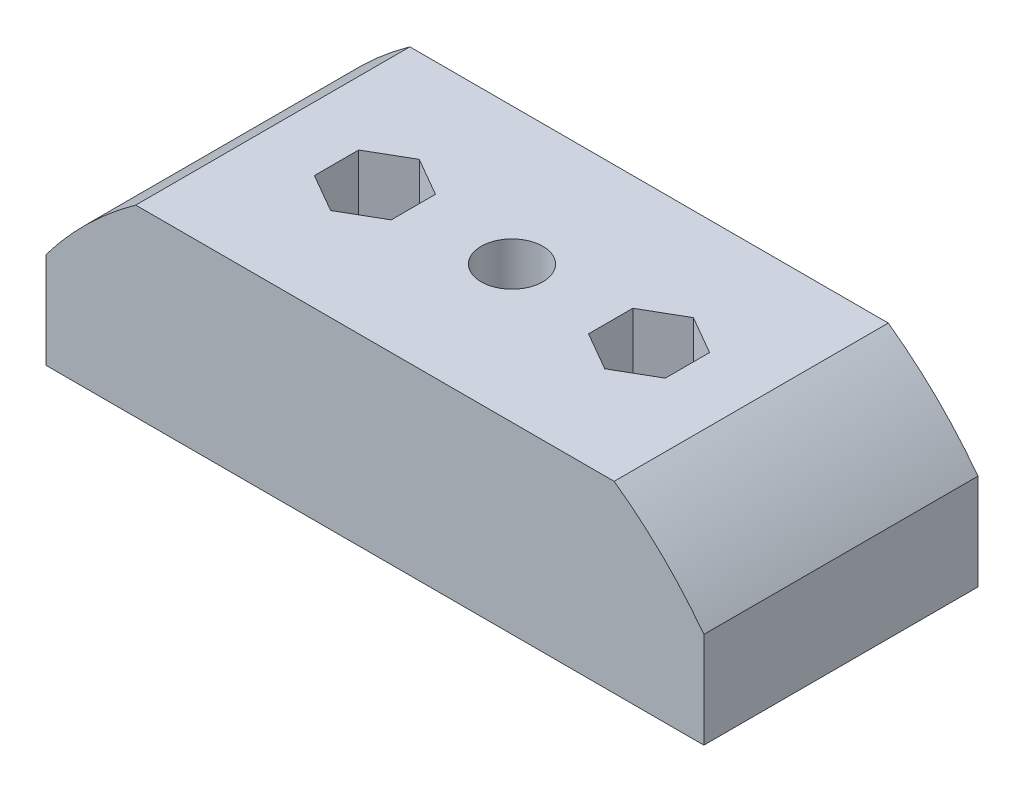
ISO-10303-21;
HEADER;
FILE_DESCRIPTION(('STEP AP214'),'2;1');
FILE_NAME('part.step','',(''),(''),'','','');
FILE_SCHEMA(('AUTOMOTIVE_DESIGN { 1 0 10303 214 1 1 1 1 }'));
ENDSEC;
DATA;
#1=APPLICATION_CONTEXT('core data for automotive mechanical design processes');
#2=APPLICATION_PROTOCOL_DEFINITION('international standard','automotive_design',2000,#1);
#3=PRODUCT_CONTEXT('',#1,'mechanical');
#4=PRODUCT('Part','Part','',(#3));
#5=PRODUCT_RELATED_PRODUCT_CATEGORY('part','',(#4));
#6=PRODUCT_DEFINITION_FORMATION('','',#4);
#7=PRODUCT_DEFINITION_CONTEXT('part definition',#1,'design');
#8=PRODUCT_DEFINITION('design','',#6,#7);
#9=PRODUCT_DEFINITION_SHAPE('','',#8);
#10=(LENGTH_UNIT() NAMED_UNIT(*) SI_UNIT(.MILLI.,.METRE.));
#11=(NAMED_UNIT(*) PLANE_ANGLE_UNIT() SI_UNIT($,.RADIAN.));
#12=(NAMED_UNIT(*) SI_UNIT($,.STERADIAN.) SOLID_ANGLE_UNIT());
#13=UNCERTAINTY_MEASURE_WITH_UNIT(LENGTH_MEASURE(1.E-05),#10,'distance_accuracy_value','');
#14=(GEOMETRIC_REPRESENTATION_CONTEXT(3) GLOBAL_UNCERTAINTY_ASSIGNED_CONTEXT((#13)) GLOBAL_UNIT_ASSIGNED_CONTEXT((#10,
#11,#12)) REPRESENTATION_CONTEXT('',''));
#15=CARTESIAN_POINT('',(0.,0.,0.));
#16=DIRECTION('',(0.,0.,1.));
#17=DIRECTION('',(1.,0.,0.));
#18=AXIS2_PLACEMENT_3D('',#15,#16,#17);
#19=CARTESIAN_POINT('',(0.,-44.001,0.));
#20=DIRECTION('',(0.,1.,0.));
#21=DIRECTION('',(-1.,0.,0.));
#22=AXIS2_PLACEMENT_3D('',#19,#20,#21);
#23=CYLINDRICAL_SURFACE('',#22,2.25);
#24=CARTESIAN_POINT('',(0.,-30.6,0.));
#25=DIRECTION('',(0.,1.,0.));
#26=DIRECTION('',(-1.,0.,0.));
#27=AXIS2_PLACEMENT_3D('',#24,#25,#26);
#28=CIRCLE('',#27,2.25);
#29=CARTESIAN_POINT('',(-2.25,-30.6,0.));
#30=VERTEX_POINT('',#29);
#31=EDGE_CURVE('E436',#30,#30,#28,.T.);
#32=ORIENTED_EDGE('',*,*,#31,.T.);
#33=EDGE_LOOP('',(#32));
#34=FACE_BOUND('',#33,.T.);
#35=CARTESIAN_POINT('',(0.,-36.6,0.));
#36=DIRECTION('',(0.,-1.,0.));
#37=DIRECTION('',(1.,0.,0.));
#38=AXIS2_PLACEMENT_3D('',#35,#36,#37);
#39=CIRCLE('',#38,2.25);
#40=CARTESIAN_POINT('',(2.25,-36.6,0.));
#41=VERTEX_POINT('',#40);
#42=EDGE_CURVE('E46',#41,#41,#39,.F.);
#43=ORIENTED_EDGE('',*,*,#42,.F.);
#44=EDGE_LOOP('',(#43));
#45=FACE_BOUND('',#44,.T.);
#46=ADVANCED_FACE('F42',(#34,#45),#23,.F.);
#47=CARTESIAN_POINT('',(-9.99999999999999,-44.001,0.));
#48=DIRECTION('',(0.,1.,0.));
#49=DIRECTION('',(-1.,0.,0.));
#50=AXIS2_PLACEMENT_3D('',#47,#48,#49);
#51=CYLINDRICAL_SURFACE('',#50,1.6);
#52=CARTESIAN_POINT('',(-9.99999999999999,-44.,0.));
#53=DIRECTION('',(0.,1.,0.));
#54=DIRECTION('',(-1.,0.,0.));
#55=AXIS2_PLACEMENT_3D('',#52,#53,#54);
#56=CIRCLE('',#55,1.6);
#57=CARTESIAN_POINT('',(-11.6,-44.,0.));
#58=VERTEX_POINT('',#57);
#59=EDGE_CURVE('E432',#58,#58,#56,.F.);
#60=ORIENTED_EDGE('',*,*,#59,.T.);
#61=EDGE_LOOP('',(#60));
#62=FACE_BOUND('',#61,.T.);
#63=CARTESIAN_POINT('',(-9.99999999999999,-38.,0.));
#64=DIRECTION('',(0.,1.,0.));
#65=DIRECTION('',(-1.,0.,0.));
#66=AXIS2_PLACEMENT_3D('',#63,#64,#65);
#67=CIRCLE('',#66,1.6);
#68=CARTESIAN_POINT('',(-11.6,-38.,0.));
#69=VERTEX_POINT('',#68);
#70=EDGE_CURVE('E441',#69,#69,#67,.F.);
#71=ORIENTED_EDGE('',*,*,#70,.F.);
#72=EDGE_LOOP('',(#71));
#73=FACE_BOUND('',#72,.T.);
#74=ADVANCED_FACE('F511',(#62,#73),#51,.F.);
#75=CARTESIAN_POINT('',(10.,-44.001,0.));
#76=DIRECTION('',(0.,1.,0.));
#77=DIRECTION('',(-1.,0.,0.));
#78=AXIS2_PLACEMENT_3D('',#75,#76,#77);
#79=CYLINDRICAL_SURFACE('',#78,1.6);
#80=CARTESIAN_POINT('',(10.,-44.,0.));
#81=DIRECTION('',(0.,1.,0.));
#82=DIRECTION('',(-1.,0.,0.));
#83=AXIS2_PLACEMENT_3D('',#80,#81,#82);
#84=CIRCLE('',#83,1.6);
#85=CARTESIAN_POINT('',(8.40000000000003,-44.,0.));
#86=VERTEX_POINT('',#85);
#87=EDGE_CURVE('E437',#86,#86,#84,.F.);
#88=ORIENTED_EDGE('',*,*,#87,.T.);
#89=EDGE_LOOP('',(#88));
#90=FACE_BOUND('',#89,.T.);
#91=CARTESIAN_POINT('',(10.,-38.,0.));
#92=DIRECTION('',(0.,1.,0.));
#93=DIRECTION('',(-1.,0.,0.));
#94=AXIS2_PLACEMENT_3D('',#91,#92,#93);
#95=CIRCLE('',#94,1.6);
#96=CARTESIAN_POINT('',(8.40000000000003,-38.,0.));
#97=VERTEX_POINT('',#96);
#98=EDGE_CURVE('E372',#97,#97,#95,.F.);
#99=ORIENTED_EDGE('',*,*,#98,.F.);
#100=EDGE_LOOP('',(#99));
#101=FACE_BOUND('',#100,.T.);
#102=ADVANCED_FACE('F513',(#90,#101),#79,.F.);
#103=CARTESIAN_POINT('',(0.,-55.,10.));
#104=DIRECTION('',(0.,0.,-1.));
#105=DIRECTION('',(-1.,0.,0.));
#106=AXIS2_PLACEMENT_3D('',#103,#104,#105);
#107=CYLINDRICAL_SURFACE('',#106,30.);
#108=CARTESIAN_POINT('',(0.,-55.,-10.));
#109=DIRECTION('',(0.,0.,1.));
#110=DIRECTION('',(1.,0.,0.));
#111=AXIS2_PLACEMENT_3D('',#108,#109,#110);
#112=CIRCLE('',#111,30.);
#113=CARTESIAN_POINT('',(-17.4539393834171,-30.6,-10.));
#114=VERTEX_POINT('',#113);
#115=CARTESIAN_POINT('',(-24.,-37.,-10.));
#116=VERTEX_POINT('',#115);
#117=EDGE_CURVE('E445',#114,#116,#112,.T.);
#118=ORIENTED_EDGE('',*,*,#117,.T.);
#119=DIRECTION('',(0.,0.,-1.));
#120=VECTOR('',#119,1.);
#121=CARTESIAN_POINT('',(-24.,-37.,10.));
#122=LINE('',#121,#120);
#123=CARTESIAN_POINT('',(-24.,-37.,10.));
#124=VERTEX_POINT('',#123);
#125=EDGE_CURVE('E12',#124,#116,#122,.T.);
#126=ORIENTED_EDGE('',*,*,#125,.F.);
#127=CARTESIAN_POINT('',(0.,-55.,10.));
#128=DIRECTION('',(0.,0.,1.));
#129=DIRECTION('',(1.,0.,0.));
#130=AXIS2_PLACEMENT_3D('',#127,#128,#129);
#131=CIRCLE('',#130,30.);
#132=CARTESIAN_POINT('',(-17.4539393834171,-30.6,10.));
#133=VERTEX_POINT('',#132);
#134=EDGE_CURVE('E446',#133,#124,#131,.T.);
#135=ORIENTED_EDGE('',*,*,#134,.F.);
#136=DIRECTION('',(0.,0.,-1.));
#137=VECTOR('',#136,1.);
#138=CARTESIAN_POINT('',(-17.4539393834171,-30.6,10.));
#139=LINE('',#138,#137);
#140=EDGE_CURVE('E466',#133,#114,#139,.T.);
#141=ORIENTED_EDGE('',*,*,#140,.T.);
#142=EDGE_LOOP('',(#118,#126,#135,#141));
#143=FACE_BOUND('',#142,.T.);
#144=ADVANCED_FACE('F44',(#143),#107,.T.);
#145=CARTESIAN_POINT('',(-24.,-37.,10.));
#146=DIRECTION('',(1.,0.,0.));
#147=DIRECTION('',(0.,1.,0.));
#148=AXIS2_PLACEMENT_3D('',#145,#146,#147);
#149=PLANE('',#148);
#150=DIRECTION('',(0.,-1.,0.));
#151=VECTOR('',#150,1.);
#152=CARTESIAN_POINT('',(-24.,-37.,-10.));
#153=LINE('',#152,#151);
#154=CARTESIAN_POINT('',(-24.,-44.,-10.));
#155=VERTEX_POINT('',#154);
#156=EDGE_CURVE('E470',#116,#155,#153,.T.);
#157=ORIENTED_EDGE('',*,*,#156,.T.);
#158=DIRECTION('',(0.,0.,-1.));
#159=VECTOR('',#158,1.);
#160=CARTESIAN_POINT('',(-24.,-44.,10.));
#161=LINE('',#160,#159);
#162=CARTESIAN_POINT('',(-24.,-44.,10.));
#163=VERTEX_POINT('',#162);
#164=EDGE_CURVE('E52',#163,#155,#161,.T.);
#165=ORIENTED_EDGE('',*,*,#164,.F.);
#166=DIRECTION('',(0.,-1.,0.));
#167=VECTOR('',#166,1.);
#168=CARTESIAN_POINT('',(-24.,-37.,10.));
#169=LINE('',#168,#167);
#170=EDGE_CURVE('E450',#124,#163,#169,.T.);
#171=ORIENTED_EDGE('',*,*,#170,.F.);
#172=ORIENTED_EDGE('',*,*,#125,.T.);
#173=EDGE_LOOP('',(#157,#165,#171,#172));
#174=FACE_BOUND('',#173,.T.);
#175=ADVANCED_FACE('F550',(#174),#149,.F.);
#176=CARTESIAN_POINT('',(-24.,-44.,10.));
#177=DIRECTION('',(0.,1.,0.));
#178=DIRECTION('',(-1.,0.,0.));
#179=AXIS2_PLACEMENT_3D('',#176,#177,#178);
#180=PLANE('',#179);
#181=DIRECTION('',(0.866025403784438,0.,0.5));
#182=VECTOR('',#181,1.);
#183=CARTESIAN_POINT('',(0.,-44.,-4.04145188432738));
#184=LINE('',#183,#182);
#185=CARTESIAN_POINT('',(0.,-44.,-4.04145188432739));
#186=VERTEX_POINT('',#185);
#187=CARTESIAN_POINT('',(3.50000000000001,-44.,-2.02072594216369));
#188=VERTEX_POINT('',#187);
#189=EDGE_CURVE('E272',#186,#188,#184,.T.);
#190=ORIENTED_EDGE('',*,*,#189,.F.);
#191=DIRECTION('',(0.866025403784439,0.,-0.5));
#192=VECTOR('',#191,1.);
#193=CARTESIAN_POINT('',(-3.49999999999999,-44.,-2.02072594216369));
#194=LINE('',#193,#192);
#195=CARTESIAN_POINT('',(-3.49999999999999,-44.,-2.02072594216369));
#196=VERTEX_POINT('',#195);
#197=EDGE_CURVE('E63',#196,#186,#194,.T.);
#198=ORIENTED_EDGE('',*,*,#197,.F.);
#199=DIRECTION('',(0.,0.,-1.));
#200=VECTOR('',#199,1.);
#201=CARTESIAN_POINT('',(-3.49999999999999,-44.,2.02072594216369));
#202=LINE('',#201,#200);
#203=CARTESIAN_POINT('',(-3.49999999999999,-44.,2.02072594216369));
#204=VERTEX_POINT('',#203);
#205=EDGE_CURVE('E292',#204,#196,#202,.T.);
#206=ORIENTED_EDGE('',*,*,#205,.F.);
#207=DIRECTION('',(-0.866025403784439,0.,-0.5));
#208=VECTOR('',#207,1.);
#209=CARTESIAN_POINT('',(0.,-44.,4.04145188432738));
#210=LINE('',#209,#208);
#211=CARTESIAN_POINT('',(0.,-44.,4.04145188432738));
#212=VERTEX_POINT('',#211);
#213=EDGE_CURVE('E285',#212,#204,#210,.T.);
#214=ORIENTED_EDGE('',*,*,#213,.F.);
#215=DIRECTION('',(-0.866025403784439,0.,0.5));
#216=VECTOR('',#215,1.);
#217=CARTESIAN_POINT('',(3.50000000000001,-44.,2.02072594216369));
#218=LINE('',#217,#216);
#219=CARTESIAN_POINT('',(3.50000000000001,-44.,2.02072594216369));
#220=VERTEX_POINT('',#219);
#221=EDGE_CURVE('E281',#220,#212,#218,.T.);
#222=ORIENTED_EDGE('',*,*,#221,.F.);
#223=DIRECTION('',(0.,0.,1.));
#224=VECTOR('',#223,1.);
#225=CARTESIAN_POINT('',(3.50000000000001,-44.,-2.02072594216369));
#226=LINE('',#225,#224);
#227=EDGE_CURVE('E261',#188,#220,#226,.T.);
#228=ORIENTED_EDGE('',*,*,#227,.F.);
#229=EDGE_LOOP('',(#190,#198,#206,#214,#222,#228));
#230=FACE_BOUND('',#229,.T.);
#231=ORIENTED_EDGE('',*,*,#87,.F.);
#232=EDGE_LOOP('',(#231));
#233=FACE_BOUND('',#232,.T.);
#234=ORIENTED_EDGE('',*,*,#59,.F.);
#235=EDGE_LOOP('',(#234));
#236=FACE_BOUND('',#235,.T.);
#237=DIRECTION('',(1.,0.,0.));
#238=VECTOR('',#237,1.);
#239=CARTESIAN_POINT('',(-24.,-44.,-10.));
#240=LINE('',#239,#238);
#241=CARTESIAN_POINT('',(24.,-44.,-10.));
#242=VERTEX_POINT('',#241);
#243=EDGE_CURVE('E473',#155,#242,#240,.T.);
#244=ORIENTED_EDGE('',*,*,#243,.T.);
#245=DIRECTION('',(0.,0.,-1.));
#246=VECTOR('',#245,1.);
#247=CARTESIAN_POINT('',(24.,-44.,10.));
#248=LINE('',#247,#246);
#249=CARTESIAN_POINT('',(24.,-44.,10.));
#250=VERTEX_POINT('',#249);
#251=EDGE_CURVE('E495',#250,#242,#248,.T.);
#252=ORIENTED_EDGE('',*,*,#251,.F.);
#253=DIRECTION('',(1.,0.,0.));
#254=VECTOR('',#253,1.);
#255=CARTESIAN_POINT('',(-24.,-44.,10.));
#256=LINE('',#255,#254);
#257=EDGE_CURVE('E454',#163,#250,#256,.T.);
#258=ORIENTED_EDGE('',*,*,#257,.F.);
#259=ORIENTED_EDGE('',*,*,#164,.T.);
#260=EDGE_LOOP('',(#244,#252,#258,#259));
#261=FACE_BOUND('',#260,.T.);
#262=ADVANCED_FACE('F277',(#230,#233,#236,#261),#180,.F.);
#263=CARTESIAN_POINT('',(24.,-44.,10.));
#264=DIRECTION('',(-1.,0.,0.));
#265=DIRECTION('',(0.,0.,1.));
#266=AXIS2_PLACEMENT_3D('',#263,#264,#265);
#267=PLANE('',#266);
#268=DIRECTION('',(0.,1.,0.));
#269=VECTOR('',#268,1.);
#270=CARTESIAN_POINT('',(24.,-44.,-10.));
#271=LINE('',#270,#269);
#272=CARTESIAN_POINT('',(24.,-37.,-10.));
#273=VERTEX_POINT('',#272);
#274=EDGE_CURVE('E476',#242,#273,#271,.T.);
#275=ORIENTED_EDGE('',*,*,#274,.T.);
#276=DIRECTION('',(0.,0.,-1.));
#277=VECTOR('',#276,1.);
#278=CARTESIAN_POINT('',(24.,-37.,10.));
#279=LINE('',#278,#277);
#280=CARTESIAN_POINT('',(24.,-37.,10.));
#281=VERTEX_POINT('',#280);
#282=EDGE_CURVE('E491',#281,#273,#279,.T.);
#283=ORIENTED_EDGE('',*,*,#282,.F.);
#284=DIRECTION('',(0.,1.,0.));
#285=VECTOR('',#284,1.);
#286=CARTESIAN_POINT('',(24.,-44.,10.));
#287=LINE('',#286,#285);
#288=EDGE_CURVE('E457',#250,#281,#287,.T.);
#289=ORIENTED_EDGE('',*,*,#288,.F.);
#290=ORIENTED_EDGE('',*,*,#251,.T.);
#291=EDGE_LOOP('',(#275,#283,#289,#290));
#292=FACE_BOUND('',#291,.T.);
#293=ADVANCED_FACE('F544',(#292),#267,.F.);
#294=CARTESIAN_POINT('',(0.,-55.,10.));
#295=DIRECTION('',(0.,0.,-1.));
#296=DIRECTION('',(-1.,0.,0.));
#297=AXIS2_PLACEMENT_3D('',#294,#295,#296);
#298=CYLINDRICAL_SURFACE('',#297,30.);
#299=CARTESIAN_POINT('',(0.,-55.,-10.));
#300=DIRECTION('',(0.,0.,1.));
#301=DIRECTION('',(1.,0.,0.));
#302=AXIS2_PLACEMENT_3D('',#299,#300,#301);
#303=CIRCLE('',#302,30.);
#304=CARTESIAN_POINT('',(17.4539393834172,-30.6,-10.));
#305=VERTEX_POINT('',#304);
#306=EDGE_CURVE('E479',#273,#305,#303,.T.);
#307=ORIENTED_EDGE('',*,*,#306,.T.);
#308=DIRECTION('',(0.,0.,-1.));
#309=VECTOR('',#308,1.);
#310=CARTESIAN_POINT('',(17.4539393834172,-30.6,10.));
#311=LINE('',#310,#309);
#312=CARTESIAN_POINT('',(17.4539393834172,-30.6,10.));
#313=VERTEX_POINT('',#312);
#314=EDGE_CURVE('E487',#313,#305,#311,.T.);
#315=ORIENTED_EDGE('',*,*,#314,.F.);
#316=CARTESIAN_POINT('',(0.,-55.,10.));
#317=DIRECTION('',(0.,0.,1.));
#318=DIRECTION('',(1.,0.,0.));
#319=AXIS2_PLACEMENT_3D('',#316,#317,#318);
#320=CIRCLE('',#319,30.);
#321=EDGE_CURVE('E460',#281,#313,#320,.T.);
#322=ORIENTED_EDGE('',*,*,#321,.F.);
#323=ORIENTED_EDGE('',*,*,#282,.T.);
#324=EDGE_LOOP('',(#307,#315,#322,#323));
#325=FACE_BOUND('',#324,.T.);
#326=ADVANCED_FACE('F540',(#325),#298,.T.);
#327=CARTESIAN_POINT('',(17.4539393834172,-30.6,10.));
#328=DIRECTION('',(0.,-1.,0.));
#329=DIRECTION('',(1.,0.,0.));
#330=AXIS2_PLACEMENT_3D('',#327,#328,#329);
#331=PLANE('',#330);
#332=DIRECTION('',(0.,0.,-1.));
#333=VECTOR('',#332,1.);
#334=CARTESIAN_POINT('',(12.8,-30.6,-1.61658075373095));
#335=LINE('',#334,#333);
#336=CARTESIAN_POINT('',(12.8,-30.6,1.61658075373095));
#337=VERTEX_POINT('',#336);
#338=CARTESIAN_POINT('',(12.8,-30.6,-1.61658075373095));
#339=VERTEX_POINT('',#338);
#340=EDGE_CURVE('E332',#337,#339,#335,.T.);
#341=ORIENTED_EDGE('',*,*,#340,.F.);
#342=DIRECTION('',(0.866025403784439,0.,-0.5));
#343=VECTOR('',#342,1.);
#344=CARTESIAN_POINT('',(12.8,-30.6,1.61658075373095));
#345=LINE('',#344,#343);
#346=CARTESIAN_POINT('',(10.,-30.6,3.2331615074619));
#347=VERTEX_POINT('',#346);
#348=EDGE_CURVE('E74',#347,#337,#345,.T.);
#349=ORIENTED_EDGE('',*,*,#348,.F.);
#350=DIRECTION('',(0.866025403784439,0.,0.5));
#351=VECTOR('',#350,1.);
#352=CARTESIAN_POINT('',(10.,-30.6,3.2331615074619));
#353=LINE('',#352,#351);
#354=CARTESIAN_POINT('',(7.20000000000003,-30.6,1.61658075373095));
#355=VERTEX_POINT('',#354);
#356=EDGE_CURVE('E349',#355,#347,#353,.T.);
#357=ORIENTED_EDGE('',*,*,#356,.F.);
#358=DIRECTION('',(0.,0.,1.));
#359=VECTOR('',#358,1.);
#360=CARTESIAN_POINT('',(7.20000000000003,-30.6,1.61658075373095));
#361=LINE('',#360,#359);
#362=CARTESIAN_POINT('',(7.20000000000003,-30.6,-1.61658075373095));
#363=VERTEX_POINT('',#362);
#364=EDGE_CURVE('E345',#363,#355,#361,.T.);
#365=ORIENTED_EDGE('',*,*,#364,.F.);
#366=DIRECTION('',(-0.866025403784439,0.,0.5));
#367=VECTOR('',#366,1.);
#368=CARTESIAN_POINT('',(7.20000000000003,-30.6,-1.61658075373095));
#369=LINE('',#368,#367);
#370=CARTESIAN_POINT('',(10.,-30.6,-3.2331615074619));
#371=VERTEX_POINT('',#370);
#372=EDGE_CURVE('E341',#371,#363,#369,.T.);
#373=ORIENTED_EDGE('',*,*,#372,.F.);
#374=DIRECTION('',(-0.866025403784439,0.,-0.5));
#375=VECTOR('',#374,1.);
#376=CARTESIAN_POINT('',(10.,-30.6,-3.2331615074619));
#377=LINE('',#376,#375);
#378=EDGE_CURVE('E337',#339,#371,#377,.T.);
#379=ORIENTED_EDGE('',*,*,#378,.F.);
#380=EDGE_LOOP('',(#341,#349,#357,#365,#373,#379));
#381=FACE_BOUND('',#380,.T.);
#382=DIRECTION('',(0.866025403784439,0.,-0.5));
#383=VECTOR('',#382,1.);
#384=CARTESIAN_POINT('',(-10.,-30.6,3.2331615074619));
#385=LINE('',#384,#383);
#386=CARTESIAN_POINT('',(-10.,-30.6,3.2331615074619));
#387=VERTEX_POINT('',#386);
#388=CARTESIAN_POINT('',(-7.2,-30.6,1.61658075373095));
#389=VERTEX_POINT('',#388);
#390=EDGE_CURVE('E392',#387,#389,#385,.T.);
#391=ORIENTED_EDGE('',*,*,#390,.F.);
#392=DIRECTION('',(0.866025403784439,0.,0.5));
#393=VECTOR('',#392,1.);
#394=CARTESIAN_POINT('',(-12.8,-30.6,1.61658075373095));
#395=LINE('',#394,#393);
#396=CARTESIAN_POINT('',(-12.8,-30.6,1.61658075373095));
#397=VERTEX_POINT('',#396);
#398=EDGE_CURVE('E389',#397,#387,#395,.T.);
#399=ORIENTED_EDGE('',*,*,#398,.F.);
#400=DIRECTION('',(0.,0.,1.));
#401=VECTOR('',#400,1.);
#402=CARTESIAN_POINT('',(-12.8,-30.6,-1.61658075373095));
#403=LINE('',#402,#401);
#404=CARTESIAN_POINT('',(-12.8,-30.6,-1.61658075373095));
#405=VERTEX_POINT('',#404);
#406=EDGE_CURVE('E408',#405,#397,#403,.T.);
#407=ORIENTED_EDGE('',*,*,#406,.F.);
#408=DIRECTION('',(-0.866025403784439,0.,0.5));
#409=VECTOR('',#408,1.);
#410=CARTESIAN_POINT('',(-9.99999999999999,-30.6,-3.2331615074619));
#411=LINE('',#410,#409);
#412=CARTESIAN_POINT('',(-9.99999999999999,-30.6,-3.2331615074619));
#413=VERTEX_POINT('',#412);
#414=EDGE_CURVE('E404',#413,#405,#411,.T.);
#415=ORIENTED_EDGE('',*,*,#414,.F.);
#416=DIRECTION('',(-0.866025403784439,0.,-0.5));
#417=VECTOR('',#416,1.);
#418=CARTESIAN_POINT('',(-7.2,-30.6,-1.61658075373095));
#419=LINE('',#418,#417);
#420=CARTESIAN_POINT('',(-7.2,-30.6,-1.61658075373095));
#421=VERTEX_POINT('',#420);
#422=EDGE_CURVE('E400',#421,#413,#419,.T.);
#423=ORIENTED_EDGE('',*,*,#422,.F.);
#424=DIRECTION('',(0.,0.,-1.));
#425=VECTOR('',#424,1.);
#426=CARTESIAN_POINT('',(-7.2,-30.6,1.61658075373095));
#427=LINE('',#426,#425);
#428=EDGE_CURVE('E396',#389,#421,#427,.T.);
#429=ORIENTED_EDGE('',*,*,#428,.F.);
#430=EDGE_LOOP('',(#391,#399,#407,#415,#423,#429));
#431=FACE_BOUND('',#430,.T.);
#432=ORIENTED_EDGE('',*,*,#31,.F.);
#433=EDGE_LOOP('',(#432));
#434=FACE_BOUND('',#433,.T.);
#435=DIRECTION('',(-1.,0.,0.));
#436=VECTOR('',#435,1.);
#437=CARTESIAN_POINT('',(17.4539393834172,-30.6,-10.));
#438=LINE('',#437,#436);
#439=EDGE_CURVE('E451',#305,#114,#438,.T.);
#440=ORIENTED_EDGE('',*,*,#439,.T.);
#441=ORIENTED_EDGE('',*,*,#140,.F.);
#442=DIRECTION('',(-1.,0.,0.));
#443=VECTOR('',#442,1.);
#444=CARTESIAN_POINT('',(17.4539393834172,-30.6,10.));
#445=LINE('',#444,#443);
#446=EDGE_CURVE('E463',#313,#133,#445,.T.);
#447=ORIENTED_EDGE('',*,*,#446,.F.);
#448=ORIENTED_EDGE('',*,*,#314,.T.);
#449=EDGE_LOOP('',(#440,#441,#447,#448));
#450=FACE_BOUND('',#449,.T.);
#451=ADVANCED_FACE('F532',(#381,#431,#434,#450),#331,.F.);
#452=CARTESIAN_POINT('',(0.,-55.,10.));
#453=DIRECTION('',(0.,0.,1.));
#454=DIRECTION('',(1.,0.,0.));
#455=AXIS2_PLACEMENT_3D('',#452,#453,#454);
#456=PLANE('',#455);
#457=ORIENTED_EDGE('',*,*,#134,.T.);
#458=ORIENTED_EDGE('',*,*,#170,.T.);
#459=ORIENTED_EDGE('',*,*,#257,.T.);
#460=ORIENTED_EDGE('',*,*,#288,.T.);
#461=ORIENTED_EDGE('',*,*,#321,.T.);
#462=ORIENTED_EDGE('',*,*,#446,.T.);
#463=EDGE_LOOP('',(#457,#458,#459,#460,#461,#462));
#464=FACE_BOUND('',#463,.T.);
#465=ADVANCED_FACE('F528',(#464),#456,.T.);
#466=CARTESIAN_POINT('',(0.,-55.,-10.));
#467=DIRECTION('',(0.,0.,1.));
#468=DIRECTION('',(1.,0.,0.));
#469=AXIS2_PLACEMENT_3D('',#466,#467,#468);
#470=PLANE('',#469);
#471=ORIENTED_EDGE('',*,*,#117,.F.);
#472=ORIENTED_EDGE('',*,*,#439,.F.);
#473=ORIENTED_EDGE('',*,*,#306,.F.);
#474=ORIENTED_EDGE('',*,*,#274,.F.);
#475=ORIENTED_EDGE('',*,*,#243,.F.);
#476=ORIENTED_EDGE('',*,*,#156,.F.);
#477=EDGE_LOOP('',(#471,#472,#473,#474,#475,#476));
#478=FACE_BOUND('',#477,.T.);
#479=ADVANCED_FACE('F531',(#478),#470,.F.);
#480=CARTESIAN_POINT('',(-24.,-38.,10.));
#481=DIRECTION('',(0.,1.,0.));
#482=DIRECTION('',(-1.,0.,0.));
#483=AXIS2_PLACEMENT_3D('',#480,#481,#482);
#484=PLANE('',#483);
#485=DIRECTION('',(-0.866025403784439,0.,0.5));
#486=VECTOR('',#485,1.);
#487=CARTESIAN_POINT('',(12.8,-38.,1.61658075373095));
#488=LINE('',#487,#486);
#489=CARTESIAN_POINT('',(12.8,-38.,1.61658075373095));
#490=VERTEX_POINT('',#489);
#491=CARTESIAN_POINT('',(10.,-38.,3.2331615074619));
#492=VERTEX_POINT('',#491);
#493=EDGE_CURVE('E326',#490,#492,#488,.T.);
#494=ORIENTED_EDGE('',*,*,#493,.F.);
#495=DIRECTION('',(0.,0.,1.));
#496=VECTOR('',#495,1.);
#497=CARTESIAN_POINT('',(12.8,-38.,-1.61658075373095));
#498=LINE('',#497,#496);
#499=CARTESIAN_POINT('',(12.8,-38.,-1.61658075373095));
#500=VERTEX_POINT('',#499);
#501=EDGE_CURVE('E329',#500,#490,#498,.T.);
#502=ORIENTED_EDGE('',*,*,#501,.F.);
#503=DIRECTION('',(0.866025403784439,0.,0.5));
#504=VECTOR('',#503,1.);
#505=CARTESIAN_POINT('',(10.,-38.,-3.2331615074619));
#506=LINE('',#505,#504);
#507=CARTESIAN_POINT('',(10.,-38.,-3.2331615074619));
#508=VERTEX_POINT('',#507);
#509=EDGE_CURVE('E313',#508,#500,#506,.T.);
#510=ORIENTED_EDGE('',*,*,#509,.F.);
#511=DIRECTION('',(0.866025403784439,0.,-0.5));
#512=VECTOR('',#511,1.);
#513=CARTESIAN_POINT('',(7.20000000000003,-38.,-1.61658075373095));
#514=LINE('',#513,#512);
#515=CARTESIAN_POINT('',(7.20000000000003,-38.,-1.61658075373095));
#516=VERTEX_POINT('',#515);
#517=EDGE_CURVE('E316',#516,#508,#514,.T.);
#518=ORIENTED_EDGE('',*,*,#517,.F.);
#519=DIRECTION('',(0.,0.,-1.));
#520=VECTOR('',#519,1.);
#521=CARTESIAN_POINT('',(7.20000000000003,-38.,1.61658075373095));
#522=LINE('',#521,#520);
#523=CARTESIAN_POINT('',(7.20000000000003,-38.,1.61658075373095));
#524=VERTEX_POINT('',#523);
#525=EDGE_CURVE('E320',#524,#516,#522,.T.);
#526=ORIENTED_EDGE('',*,*,#525,.F.);
#527=DIRECTION('',(-0.866025403784439,0.,-0.5));
#528=VECTOR('',#527,1.);
#529=CARTESIAN_POINT('',(10.,-38.,3.2331615074619));
#530=LINE('',#529,#528);
#531=EDGE_CURVE('E323',#492,#524,#530,.T.);
#532=ORIENTED_EDGE('',*,*,#531,.F.);
#533=EDGE_LOOP('',(#494,#502,#510,#518,#526,#532));
#534=FACE_BOUND('',#533,.T.);
#535=ORIENTED_EDGE('',*,*,#98,.T.);
#536=EDGE_LOOP('',(#535));
#537=FACE_BOUND('',#536,.T.);
#538=ADVANCED_FACE('F536',(#534,#537),#484,.T.);
#539=CARTESIAN_POINT('',(12.8,-52.5541412972509,1.61658075373095));
#540=DIRECTION('',(0.5,0.,0.866025403784438));
#541=DIRECTION('',(0.866025403784439,0.,-0.5));
#542=AXIS2_PLACEMENT_3D('',#539,#540,#541);
#543=PLANE('',#542);
#544=ORIENTED_EDGE('',*,*,#493,.T.);
#545=DIRECTION('',(0.,1.,0.));
#546=VECTOR('',#545,1.);
#547=CARTESIAN_POINT('',(10.,-52.5541412972509,3.2331615074619));
#548=LINE('',#547,#546);
#549=EDGE_CURVE('E317',#492,#347,#548,.T.);
#550=ORIENTED_EDGE('',*,*,#549,.T.);
#551=ORIENTED_EDGE('',*,*,#348,.T.);
#552=DIRECTION('',(0.,1.,0.));
#553=VECTOR('',#552,1.);
#554=CARTESIAN_POINT('',(12.8,-52.5541412972509,1.61658075373095));
#555=LINE('',#554,#553);
#556=EDGE_CURVE('E353',#490,#337,#555,.T.);
#557=ORIENTED_EDGE('',*,*,#556,.F.);
#558=EDGE_LOOP('',(#544,#550,#551,#557));
#559=FACE_BOUND('',#558,.T.);
#560=ADVANCED_FACE('F613',(#559),#543,.F.);
#561=CARTESIAN_POINT('',(10.,-52.5541412972509,3.2331615074619));
#562=DIRECTION('',(-0.5,0.,0.866025403784439));
#563=DIRECTION('',(0.866025403784439,0.,0.5));
#564=AXIS2_PLACEMENT_3D('',#561,#562,#563);
#565=PLANE('',#564);
#566=ORIENTED_EDGE('',*,*,#531,.T.);
#567=DIRECTION('',(0.,1.,0.));
#568=VECTOR('',#567,1.);
#569=CARTESIAN_POINT('',(7.20000000000003,-52.5541412972509,1.61658075373095));
#570=LINE('',#569,#568);
#571=EDGE_CURVE('E356',#524,#355,#570,.T.);
#572=ORIENTED_EDGE('',*,*,#571,.T.);
#573=ORIENTED_EDGE('',*,*,#356,.T.);
#574=ORIENTED_EDGE('',*,*,#549,.F.);
#575=EDGE_LOOP('',(#566,#572,#573,#574));
#576=FACE_BOUND('',#575,.T.);
#577=ADVANCED_FACE('F624',(#576),#565,.F.);
#578=CARTESIAN_POINT('',(7.20000000000003,-52.5541412972509,1.61658075373095));
#579=DIRECTION('',(-1.,0.,0.));
#580=DIRECTION('',(0.,-1.,0.));
#581=AXIS2_PLACEMENT_3D('',#578,#579,#580);
#582=PLANE('',#581);
#583=ORIENTED_EDGE('',*,*,#525,.T.);
#584=DIRECTION('',(0.,1.,0.));
#585=VECTOR('',#584,1.);
#586=CARTESIAN_POINT('',(7.20000000000003,-52.5541412972509,-1.61658075373095));
#587=LINE('',#586,#585);
#588=EDGE_CURVE('E359',#516,#363,#587,.T.);
#589=ORIENTED_EDGE('',*,*,#588,.T.);
#590=ORIENTED_EDGE('',*,*,#364,.T.);
#591=ORIENTED_EDGE('',*,*,#571,.F.);
#592=EDGE_LOOP('',(#583,#589,#590,#591));
#593=FACE_BOUND('',#592,.T.);
#594=ADVANCED_FACE('F633',(#593),#582,.F.);
#595=CARTESIAN_POINT('',(7.20000000000003,-52.5541412972509,-1.61658075373095));
#596=DIRECTION('',(-0.5,0.,-0.866025403784439));
#597=DIRECTION('',(-0.866025403784439,0.,0.5));
#598=AXIS2_PLACEMENT_3D('',#595,#596,#597);
#599=PLANE('',#598);
#600=ORIENTED_EDGE('',*,*,#517,.T.);
#601=DIRECTION('',(0.,1.,0.));
#602=VECTOR('',#601,1.);
#603=CARTESIAN_POINT('',(10.,-52.5541412972509,-3.2331615074619));
#604=LINE('',#603,#602);
#605=EDGE_CURVE('E362',#508,#371,#604,.T.);
#606=ORIENTED_EDGE('',*,*,#605,.T.);
#607=ORIENTED_EDGE('',*,*,#372,.T.);
#608=ORIENTED_EDGE('',*,*,#588,.F.);
#609=EDGE_LOOP('',(#600,#606,#607,#608));
#610=FACE_BOUND('',#609,.T.);
#611=ADVANCED_FACE('F643',(#610),#599,.F.);
#612=CARTESIAN_POINT('',(10.,-52.5541412972509,-3.2331615074619));
#613=DIRECTION('',(0.5,0.,-0.866025403784439));
#614=DIRECTION('',(-0.866025403784439,0.,-0.5));
#615=AXIS2_PLACEMENT_3D('',#612,#613,#614);
#616=PLANE('',#615);
#617=ORIENTED_EDGE('',*,*,#509,.T.);
#618=DIRECTION('',(0.,1.,0.));
#619=VECTOR('',#618,1.);
#620=CARTESIAN_POINT('',(12.8,-52.5541412972509,-1.61658075373095));
#621=LINE('',#620,#619);
#622=EDGE_CURVE('E365',#500,#339,#621,.T.);
#623=ORIENTED_EDGE('',*,*,#622,.T.);
#624=ORIENTED_EDGE('',*,*,#378,.T.);
#625=ORIENTED_EDGE('',*,*,#605,.F.);
#626=EDGE_LOOP('',(#617,#623,#624,#625));
#627=FACE_BOUND('',#626,.T.);
#628=ADVANCED_FACE('F653',(#627),#616,.F.);
#629=CARTESIAN_POINT('',(12.8,-52.5541412972509,-1.61658075373095));
#630=DIRECTION('',(1.,0.,0.));
#631=DIRECTION('',(0.,1.,0.));
#632=AXIS2_PLACEMENT_3D('',#629,#630,#631);
#633=PLANE('',#632);
#634=ORIENTED_EDGE('',*,*,#501,.T.);
#635=ORIENTED_EDGE('',*,*,#556,.T.);
#636=ORIENTED_EDGE('',*,*,#340,.T.);
#637=ORIENTED_EDGE('',*,*,#622,.F.);
#638=EDGE_LOOP('',(#634,#635,#636,#637));
#639=FACE_BOUND('',#638,.T.);
#640=ADVANCED_FACE('F663',(#639),#633,.F.);
#641=CARTESIAN_POINT('',(-24.,-38.,10.));
#642=DIRECTION('',(0.,1.,0.));
#643=DIRECTION('',(-1.,0.,0.));
#644=AXIS2_PLACEMENT_3D('',#641,#642,#643);
#645=PLANE('',#644);
#646=DIRECTION('',(-0.866025403784439,0.,-0.5));
#647=VECTOR('',#646,1.);
#648=CARTESIAN_POINT('',(-12.8,-38.,1.61658075373095));
#649=LINE('',#648,#647);
#650=CARTESIAN_POINT('',(-10.,-38.,3.2331615074619));
#651=VERTEX_POINT('',#650);
#652=CARTESIAN_POINT('',(-12.8,-38.,1.61658075373095));
#653=VERTEX_POINT('',#652);
#654=EDGE_CURVE('E386',#651,#653,#649,.T.);
#655=ORIENTED_EDGE('',*,*,#654,.F.);
#656=DIRECTION('',(-0.866025403784439,0.,0.5));
#657=VECTOR('',#656,1.);
#658=CARTESIAN_POINT('',(-10.,-38.,3.2331615074619));
#659=LINE('',#658,#657);
#660=CARTESIAN_POINT('',(-7.2,-38.,1.61658075373095));
#661=VERTEX_POINT('',#660);
#662=EDGE_CURVE('E333',#661,#651,#659,.T.);
#663=ORIENTED_EDGE('',*,*,#662,.F.);
#664=DIRECTION('',(0.,0.,1.));
#665=VECTOR('',#664,1.);
#666=CARTESIAN_POINT('',(-7.2,-38.,1.61658075373095));
#667=LINE('',#666,#665);
#668=CARTESIAN_POINT('',(-7.2,-38.,-1.61658075373095));
#669=VERTEX_POINT('',#668);
#670=EDGE_CURVE('E373',#669,#661,#667,.T.);
#671=ORIENTED_EDGE('',*,*,#670,.F.);
#672=DIRECTION('',(0.866025403784439,0.,0.5));
#673=VECTOR('',#672,1.);
#674=CARTESIAN_POINT('',(-7.2,-38.,-1.61658075373095));
#675=LINE('',#674,#673);
#676=CARTESIAN_POINT('',(-9.99999999999999,-38.,-3.2331615074619));
#677=VERTEX_POINT('',#676);
#678=EDGE_CURVE('E376',#677,#669,#675,.T.);
#679=ORIENTED_EDGE('',*,*,#678,.F.);
#680=DIRECTION('',(0.866025403784439,0.,-0.5));
#681=VECTOR('',#680,1.);
#682=CARTESIAN_POINT('',(-9.99999999999999,-38.,-3.2331615074619));
#683=LINE('',#682,#681);
#684=CARTESIAN_POINT('',(-12.8,-38.,-1.61658075373095));
#685=VERTEX_POINT('',#684);
#686=EDGE_CURVE('E380',#685,#677,#683,.T.);
#687=ORIENTED_EDGE('',*,*,#686,.F.);
#688=DIRECTION('',(0.,0.,-1.));
#689=VECTOR('',#688,1.);
#690=CARTESIAN_POINT('',(-12.8,-38.,-1.61658075373095));
#691=LINE('',#690,#689);
#692=EDGE_CURVE('E383',#653,#685,#691,.T.);
#693=ORIENTED_EDGE('',*,*,#692,.F.);
#694=EDGE_LOOP('',(#655,#663,#671,#679,#687,#693));
#695=FACE_BOUND('',#694,.T.);
#696=ORIENTED_EDGE('',*,*,#70,.T.);
#697=EDGE_LOOP('',(#696));
#698=FACE_BOUND('',#697,.T.);
#699=ADVANCED_FACE('F509',(#695,#698),#645,.T.);
#700=CARTESIAN_POINT('',(-12.8,-52.5541412972509,1.61658075373095));
#701=DIRECTION('',(-0.5,0.,0.866025403784438));
#702=DIRECTION('',(0.866025403784439,0.,0.5));
#703=AXIS2_PLACEMENT_3D('',#700,#701,#702);
#704=PLANE('',#703);
#705=ORIENTED_EDGE('',*,*,#654,.T.);
#706=DIRECTION('',(0.,1.,0.));
#707=VECTOR('',#706,1.);
#708=CARTESIAN_POINT('',(-12.8,-52.5541412972509,1.61658075373095));
#709=LINE('',#708,#707);
#710=EDGE_CURVE('E377',#653,#397,#709,.T.);
#711=ORIENTED_EDGE('',*,*,#710,.T.);
#712=ORIENTED_EDGE('',*,*,#398,.T.);
#713=DIRECTION('',(0.,1.,0.));
#714=VECTOR('',#713,1.);
#715=CARTESIAN_POINT('',(-10.,-52.5541412972509,3.2331615074619));
#716=LINE('',#715,#714);
#717=EDGE_CURVE('E412',#651,#387,#716,.T.);
#718=ORIENTED_EDGE('',*,*,#717,.F.);
#719=EDGE_LOOP('',(#705,#711,#712,#718));
#720=FACE_BOUND('',#719,.T.);
#721=ADVANCED_FACE('F525',(#720),#704,.F.);
#722=CARTESIAN_POINT('',(-12.8,-52.5541412972509,-1.61658075373095));
#723=DIRECTION('',(-1.,0.,0.));
#724=DIRECTION('',(0.,-1.,0.));
#725=AXIS2_PLACEMENT_3D('',#722,#723,#724);
#726=PLANE('',#725);
#727=ORIENTED_EDGE('',*,*,#692,.T.);
#728=DIRECTION('',(0.,1.,0.));
#729=VECTOR('',#728,1.);
#730=CARTESIAN_POINT('',(-12.8,-52.5541412972509,-1.61658075373095));
#731=LINE('',#730,#729);
#732=EDGE_CURVE('E415',#685,#405,#731,.T.);
#733=ORIENTED_EDGE('',*,*,#732,.T.);
#734=ORIENTED_EDGE('',*,*,#406,.T.);
#735=ORIENTED_EDGE('',*,*,#710,.F.);
#736=EDGE_LOOP('',(#727,#733,#734,#735));
#737=FACE_BOUND('',#736,.T.);
#738=ADVANCED_FACE('F691',(#737),#726,.F.);
#739=CARTESIAN_POINT('',(-9.99999999999999,-52.5541412972509,-3.2331615074619));
#740=DIRECTION('',(-0.5,0.,-0.866025403784439));
#741=DIRECTION('',(-0.866025403784439,0.,0.5));
#742=AXIS2_PLACEMENT_3D('',#739,#740,#741);
#743=PLANE('',#742);
#744=ORIENTED_EDGE('',*,*,#686,.T.);
#745=DIRECTION('',(0.,1.,0.));
#746=VECTOR('',#745,1.);
#747=CARTESIAN_POINT('',(-9.99999999999999,-52.5541412972509,-3.2331615074619));
#748=LINE('',#747,#746);
#749=EDGE_CURVE('E418',#677,#413,#748,.T.);
#750=ORIENTED_EDGE('',*,*,#749,.T.);
#751=ORIENTED_EDGE('',*,*,#414,.T.);
#752=ORIENTED_EDGE('',*,*,#732,.F.);
#753=EDGE_LOOP('',(#744,#750,#751,#752));
#754=FACE_BOUND('',#753,.T.);
#755=ADVANCED_FACE('F700',(#754),#743,.F.);
#756=CARTESIAN_POINT('',(-7.19999999999999,-52.5541412972509,-1.61658075373095));
#757=DIRECTION('',(0.5,0.,-0.866025403784439));
#758=DIRECTION('',(-0.866025403784439,0.,-0.5));
#759=AXIS2_PLACEMENT_3D('',#756,#757,#758);
#760=PLANE('',#759);
#761=ORIENTED_EDGE('',*,*,#678,.T.);
#762=DIRECTION('',(0.,1.,0.));
#763=VECTOR('',#762,1.);
#764=CARTESIAN_POINT('',(-7.19999999999999,-52.5541412972509,-1.61658075373095));
#765=LINE('',#764,#763);
#766=EDGE_CURVE('E421',#669,#421,#765,.T.);
#767=ORIENTED_EDGE('',*,*,#766,.T.);
#768=ORIENTED_EDGE('',*,*,#422,.T.);
#769=ORIENTED_EDGE('',*,*,#749,.F.);
#770=EDGE_LOOP('',(#761,#767,#768,#769));
#771=FACE_BOUND('',#770,.T.);
#772=ADVANCED_FACE('F710',(#771),#760,.F.);
#773=CARTESIAN_POINT('',(-7.19999999999999,-52.5541412972509,1.61658075373095));
#774=DIRECTION('',(1.,0.,0.));
#775=DIRECTION('',(0.,1.,0.));
#776=AXIS2_PLACEMENT_3D('',#773,#774,#775);
#777=PLANE('',#776);
#778=ORIENTED_EDGE('',*,*,#670,.T.);
#779=DIRECTION('',(0.,1.,0.));
#780=VECTOR('',#779,1.);
#781=CARTESIAN_POINT('',(-7.19999999999999,-52.5541412972509,1.61658075373095));
#782=LINE('',#781,#780);
#783=EDGE_CURVE('E424',#661,#389,#782,.T.);
#784=ORIENTED_EDGE('',*,*,#783,.T.);
#785=ORIENTED_EDGE('',*,*,#428,.T.);
#786=ORIENTED_EDGE('',*,*,#766,.F.);
#787=EDGE_LOOP('',(#778,#784,#785,#786));
#788=FACE_BOUND('',#787,.T.);
#789=ADVANCED_FACE('F720',(#788),#777,.F.);
#790=CARTESIAN_POINT('',(-10.,-52.5541412972509,3.2331615074619));
#791=DIRECTION('',(0.5,0.,0.866025403784439));
#792=DIRECTION('',(0.866025403784439,0.,-0.5));
#793=AXIS2_PLACEMENT_3D('',#790,#791,#792);
#794=PLANE('',#793);
#795=ORIENTED_EDGE('',*,*,#662,.T.);
#796=ORIENTED_EDGE('',*,*,#717,.T.);
#797=ORIENTED_EDGE('',*,*,#390,.T.);
#798=ORIENTED_EDGE('',*,*,#783,.F.);
#799=EDGE_LOOP('',(#795,#796,#797,#798));
#800=FACE_BOUND('',#799,.T.);
#801=ADVANCED_FACE('F730',(#800),#794,.F.);
#802=CARTESIAN_POINT('',(17.4539393834172,-36.6,10.));
#803=DIRECTION('',(0.,-1.,0.));
#804=DIRECTION('',(1.,0.,0.));
#805=AXIS2_PLACEMENT_3D('',#802,#803,#804);
#806=PLANE('',#805);
#807=DIRECTION('',(-0.866025403784439,0.,0.5));
#808=VECTOR('',#807,1.);
#809=CARTESIAN_POINT('',(-3.5,-36.6,-2.02072594216369));
#810=LINE('',#809,#808);
#811=CARTESIAN_POINT('',(0.,-36.6,-4.04145188432738));
#812=VERTEX_POINT('',#811);
#813=CARTESIAN_POINT('',(-3.49999999999999,-36.6,-2.02072594216369));
#814=VERTEX_POINT('',#813);
#815=EDGE_CURVE('E312',#812,#814,#810,.T.);
#816=ORIENTED_EDGE('',*,*,#815,.F.);
#817=DIRECTION('',(-0.866025403784439,0.,-0.5));
#818=VECTOR('',#817,1.);
#819=CARTESIAN_POINT('',(0.,-36.6,-4.04145188432738));
#820=LINE('',#819,#818);
#821=CARTESIAN_POINT('',(3.50000000000001,-36.6,-2.02072594216369));
#822=VERTEX_POINT('',#821);
#823=EDGE_CURVE('E309',#822,#812,#820,.T.);
#824=ORIENTED_EDGE('',*,*,#823,.F.);
#825=DIRECTION('',(0.,0.,-1.));
#826=VECTOR('',#825,1.);
#827=CARTESIAN_POINT('',(3.50000000000001,-36.6,-2.02072594216369));
#828=LINE('',#827,#826);
#829=CARTESIAN_POINT('',(3.5,-36.6,2.02072594216369));
#830=VERTEX_POINT('',#829);
#831=EDGE_CURVE('E264',#830,#822,#828,.T.);
#832=ORIENTED_EDGE('',*,*,#831,.F.);
#833=DIRECTION('',(0.866025403784439,0.,-0.5));
#834=VECTOR('',#833,1.);
#835=CARTESIAN_POINT('',(3.5,-36.6,2.02072594216369));
#836=LINE('',#835,#834);
#837=CARTESIAN_POINT('',(0.,-36.6,4.04145188432738));
#838=VERTEX_POINT('',#837);
#839=EDGE_CURVE('E822',#838,#830,#836,.T.);
#840=ORIENTED_EDGE('',*,*,#839,.F.);
#841=DIRECTION('',(0.866025403784439,0.,0.5));
#842=VECTOR('',#841,1.);
#843=CARTESIAN_POINT('',(0.,-36.6,4.04145188432738));
#844=LINE('',#843,#842);
#845=CARTESIAN_POINT('',(-3.5,-36.6,2.02072594216369));
#846=VERTEX_POINT('',#845);
#847=EDGE_CURVE('E825',#846,#838,#844,.T.);
#848=ORIENTED_EDGE('',*,*,#847,.F.);
#849=DIRECTION('',(0.,0.,1.));
#850=VECTOR('',#849,1.);
#851=CARTESIAN_POINT('',(-3.49999999999999,-36.6,2.02072594216369));
#852=LINE('',#851,#850);
#853=EDGE_CURVE('E833',#814,#846,#852,.T.);
#854=ORIENTED_EDGE('',*,*,#853,.F.);
#855=EDGE_LOOP('',(#816,#824,#832,#840,#848,#854));
#856=FACE_BOUND('',#855,.T.);
#857=ORIENTED_EDGE('',*,*,#42,.T.);
#858=EDGE_LOOP('',(#857));
#859=FACE_BOUND('',#858,.T.);
#860=ADVANCED_FACE('F740',(#856,#859),#806,.T.);
#861=CARTESIAN_POINT('',(-3.5,-19.9073233784363,-2.02072594216369));
#862=DIRECTION('',(-0.5,0.,-0.866025403784438));
#863=DIRECTION('',(-0.866025403784439,0.,0.5));
#864=AXIS2_PLACEMENT_3D('',#861,#862,#863);
#865=PLANE('',#864);
#866=ORIENTED_EDGE('',*,*,#815,.T.);
#867=DIRECTION('',(0.,-1.,0.));
#868=VECTOR('',#867,1.);
#869=CARTESIAN_POINT('',(-3.5,-19.9073233784363,-2.02072594216369));
#870=LINE('',#869,#868);
#871=EDGE_CURVE('E296',#814,#196,#870,.T.);
#872=ORIENTED_EDGE('',*,*,#871,.T.);
#873=ORIENTED_EDGE('',*,*,#197,.T.);
#874=DIRECTION('',(0.,-1.,0.));
#875=VECTOR('',#874,1.);
#876=CARTESIAN_POINT('',(0.,-19.9073233784363,-4.04145188432738));
#877=LINE('',#876,#875);
#878=EDGE_CURVE('E269',#812,#186,#877,.T.);
#879=ORIENTED_EDGE('',*,*,#878,.F.);
#880=EDGE_LOOP('',(#866,#872,#873,#879));
#881=FACE_BOUND('',#880,.T.);
#882=ADVANCED_FACE('F764',(#881),#865,.F.);
#883=CARTESIAN_POINT('',(-3.5,-19.9073233784363,2.02072594216369));
#884=DIRECTION('',(-1.,0.,0.));
#885=DIRECTION('',(0.,-1.,0.));
#886=AXIS2_PLACEMENT_3D('',#883,#884,#885);
#887=PLANE('',#886);
#888=ORIENTED_EDGE('',*,*,#853,.T.);
#889=DIRECTION('',(0.,-1.,0.));
#890=VECTOR('',#889,1.);
#891=CARTESIAN_POINT('',(-3.5,-19.9073233784363,2.02072594216369));
#892=LINE('',#891,#890);
#893=EDGE_CURVE('E299',#846,#204,#892,.T.);
#894=ORIENTED_EDGE('',*,*,#893,.T.);
#895=ORIENTED_EDGE('',*,*,#205,.T.);
#896=ORIENTED_EDGE('',*,*,#871,.F.);
#897=EDGE_LOOP('',(#888,#894,#895,#896));
#898=FACE_BOUND('',#897,.T.);
#899=ADVANCED_FACE('F774',(#898),#887,.F.);
#900=CARTESIAN_POINT('',(0.,-19.9073233784363,4.04145188432738));
#901=DIRECTION('',(-0.5,0.,0.866025403784439));
#902=DIRECTION('',(0.866025403784439,0.,0.5));
#903=AXIS2_PLACEMENT_3D('',#900,#901,#902);
#904=PLANE('',#903);
#905=ORIENTED_EDGE('',*,*,#847,.T.);
#906=DIRECTION('',(0.,-1.,0.));
#907=VECTOR('',#906,1.);
#908=CARTESIAN_POINT('',(0.,-19.9073233784363,4.04145188432738));
#909=LINE('',#908,#907);
#910=EDGE_CURVE('E302',#838,#212,#909,.T.);
#911=ORIENTED_EDGE('',*,*,#910,.T.);
#912=ORIENTED_EDGE('',*,*,#213,.T.);
#913=ORIENTED_EDGE('',*,*,#893,.F.);
#914=EDGE_LOOP('',(#905,#911,#912,#913));
#915=FACE_BOUND('',#914,.T.);
#916=ADVANCED_FACE('F587',(#915),#904,.F.);
#917=CARTESIAN_POINT('',(3.5,-19.9073233784363,2.02072594216369));
#918=DIRECTION('',(0.5,0.,0.866025403784439));
#919=DIRECTION('',(0.866025403784439,0.,-0.5));
#920=AXIS2_PLACEMENT_3D('',#917,#918,#919);
#921=PLANE('',#920);
#922=ORIENTED_EDGE('',*,*,#839,.T.);
#923=DIRECTION('',(0.,-1.,0.));
#924=VECTOR('',#923,1.);
#925=CARTESIAN_POINT('',(3.5,-19.9073233784363,2.02072594216369));
#926=LINE('',#925,#924);
#927=EDGE_CURVE('E268',#830,#220,#926,.T.);
#928=ORIENTED_EDGE('',*,*,#927,.T.);
#929=ORIENTED_EDGE('',*,*,#221,.T.);
#930=ORIENTED_EDGE('',*,*,#910,.F.);
#931=EDGE_LOOP('',(#922,#928,#929,#930));
#932=FACE_BOUND('',#931,.T.);
#933=ADVANCED_FACE('F790',(#932),#921,.F.);
#934=CARTESIAN_POINT('',(3.5,-19.9073233784363,-2.02072594216369));
#935=DIRECTION('',(1.,0.,0.));
#936=DIRECTION('',(0.,1.,0.));
#937=AXIS2_PLACEMENT_3D('',#934,#935,#936);
#938=PLANE('',#937);
#939=ORIENTED_EDGE('',*,*,#831,.T.);
#940=DIRECTION('',(0.,-1.,0.));
#941=VECTOR('',#940,1.);
#942=CARTESIAN_POINT('',(3.5,-19.9073233784363,-2.02072594216369));
#943=LINE('',#942,#941);
#944=EDGE_CURVE('E256',#822,#188,#943,.T.);
#945=ORIENTED_EDGE('',*,*,#944,.T.);
#946=ORIENTED_EDGE('',*,*,#227,.T.);
#947=ORIENTED_EDGE('',*,*,#927,.F.);
#948=EDGE_LOOP('',(#939,#945,#946,#947));
#949=FACE_BOUND('',#948,.T.);
#950=ADVANCED_FACE('F258',(#949),#938,.F.);
#951=CARTESIAN_POINT('',(0.,-19.9073233784363,-4.04145188432738));
#952=DIRECTION('',(0.5,0.,-0.866025403784438));
#953=DIRECTION('',(-0.866025403784439,0.,-0.5));
#954=AXIS2_PLACEMENT_3D('',#951,#952,#953);
#955=PLANE('',#954);
#956=ORIENTED_EDGE('',*,*,#823,.T.);
#957=ORIENTED_EDGE('',*,*,#878,.T.);
#958=ORIENTED_EDGE('',*,*,#189,.T.);
#959=ORIENTED_EDGE('',*,*,#944,.F.);
#960=EDGE_LOOP('',(#956,#957,#958,#959));
#961=FACE_BOUND('',#960,.T.);
#962=ADVANCED_FACE('F273',(#961),#955,.F.);
#963=CLOSED_SHELL('',(#46,#74,#102,#144,#175,#262,#293,#326,#451,#465,#479,#538,#560,#577,#594,
#611,#628,#640,#699,#721,#738,#755,#772,#789,#801,#860,#882,#899,#916,#933,#950,#962));
#964=MANIFOLD_SOLID_BREP('B2',#963);
#965=ADVANCED_BREP_SHAPE_REPRESENTATION('',(#18,#964),#14);
#966=SHAPE_DEFINITION_REPRESENTATION(#9,#965);
ENDSEC;
END-ISO-10303-21;
